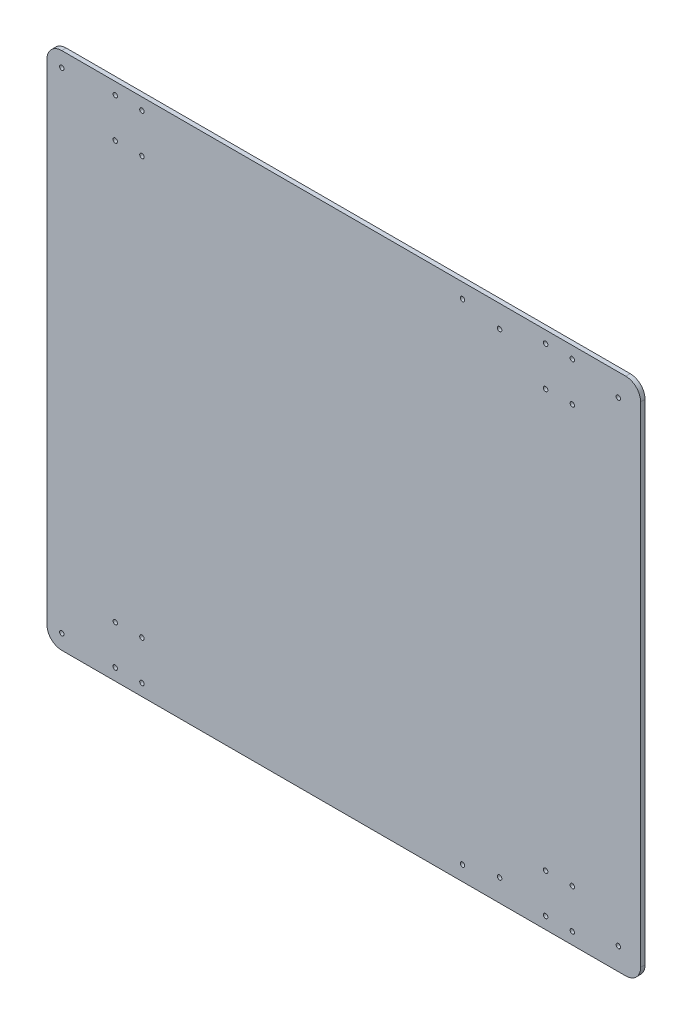
ISO-10303-21;
HEADER;
FILE_DESCRIPTION(('STEP AP214'),'2;1');
FILE_NAME('part.step','',(''),(''),'','','');
FILE_SCHEMA(('AUTOMOTIVE_DESIGN { 1 0 10303 214 1 1 1 1 }'));
ENDSEC;
DATA;
#1=APPLICATION_CONTEXT('core data for automotive mechanical design processes');
#2=APPLICATION_PROTOCOL_DEFINITION('international standard','automotive_design',2000,#1);
#3=PRODUCT_CONTEXT('',#1,'mechanical');
#4=PRODUCT('Part','Part','',(#3));
#5=PRODUCT_RELATED_PRODUCT_CATEGORY('part','',(#4));
#6=PRODUCT_DEFINITION_FORMATION('','',#4);
#7=PRODUCT_DEFINITION_CONTEXT('part definition',#1,'design');
#8=PRODUCT_DEFINITION('design','',#6,#7);
#9=PRODUCT_DEFINITION_SHAPE('','',#8);
#10=(LENGTH_UNIT() NAMED_UNIT(*) SI_UNIT(.MILLI.,.METRE.));
#11=(NAMED_UNIT(*) PLANE_ANGLE_UNIT() SI_UNIT($,.RADIAN.));
#12=(NAMED_UNIT(*) SI_UNIT($,.STERADIAN.) SOLID_ANGLE_UNIT());
#13=UNCERTAINTY_MEASURE_WITH_UNIT(LENGTH_MEASURE(1.E-05),#10,'distance_accuracy_value','');
#14=(GEOMETRIC_REPRESENTATION_CONTEXT(3) GLOBAL_UNCERTAINTY_ASSIGNED_CONTEXT((#13)) GLOBAL_UNIT_ASSIGNED_CONTEXT((#10,
#11,#12)) REPRESENTATION_CONTEXT('',''));
#15=CARTESIAN_POINT('',(0.,0.,0.));
#16=DIRECTION('',(0.,0.,1.));
#17=DIRECTION('',(1.,0.,0.));
#18=AXIS2_PLACEMENT_3D('',#15,#16,#17);
#19=CARTESIAN_POINT('',(390.,340.,3.));
#20=DIRECTION('',(0.,0.,-1.));
#21=DIRECTION('',(-1.,0.,0.));
#22=AXIS2_PLACEMENT_3D('',#19,#20,#21);
#23=CYLINDRICAL_SURFACE('',#22,10.);
#24=CARTESIAN_POINT('',(390.,340.,0.));
#25=DIRECTION('',(0.,0.,1.));
#26=DIRECTION('',(1.,0.,0.));
#27=AXIS2_PLACEMENT_3D('',#24,#25,#26);
#28=CIRCLE('',#27,10.);
#29=CARTESIAN_POINT('',(390.,350.,0.));
#30=VERTEX_POINT('',#29);
#31=CARTESIAN_POINT('',(400.,340.,0.));
#32=VERTEX_POINT('',#31);
#33=EDGE_CURVE('E157',#30,#32,#28,.F.);
#34=ORIENTED_EDGE('',*,*,#33,.F.);
#35=DIRECTION('',(0.,0.,-1.));
#36=VECTOR('',#35,1.);
#37=CARTESIAN_POINT('',(390.,350.,3.));
#38=LINE('',#37,#36);
#39=CARTESIAN_POINT('',(390.,350.,3.));
#40=VERTEX_POINT('',#39);
#41=EDGE_CURVE('E11',#40,#30,#38,.T.);
#42=ORIENTED_EDGE('',*,*,#41,.F.);
#43=CARTESIAN_POINT('',(390.,340.,3.));
#44=DIRECTION('',(0.,0.,1.));
#45=DIRECTION('',(1.,0.,0.));
#46=AXIS2_PLACEMENT_3D('',#43,#44,#45);
#47=CIRCLE('',#46,10.);
#48=CARTESIAN_POINT('',(400.,340.,3.));
#49=VERTEX_POINT('',#48);
#50=EDGE_CURVE('E638',#40,#49,#47,.F.);
#51=ORIENTED_EDGE('',*,*,#50,.T.);
#52=DIRECTION('',(0.,0.,-1.));
#53=VECTOR('',#52,1.);
#54=CARTESIAN_POINT('',(400.,340.,3.));
#55=LINE('',#54,#53);
#56=EDGE_CURVE('E91',#49,#32,#55,.T.);
#57=ORIENTED_EDGE('',*,*,#56,.T.);
#58=EDGE_LOOP('',(#34,#42,#51,#57));
#59=FACE_BOUND('',#58,.T.);
#60=ADVANCED_FACE('F40',(#59),#23,.T.);
#61=CARTESIAN_POINT('',(0.,350.,3.));
#62=DIRECTION('',(0.,1.,0.));
#63=DIRECTION('',(0.,0.,1.));
#64=AXIS2_PLACEMENT_3D('',#61,#62,#63);
#65=PLANE('',#64);
#66=DIRECTION('',(1.,0.,0.));
#67=VECTOR('',#66,1.);
#68=CARTESIAN_POINT('',(0.,350.,0.));
#69=LINE('',#68,#67);
#70=CARTESIAN_POINT('',(10.0000000000001,350.,0.));
#71=VERTEX_POINT('',#70);
#72=EDGE_CURVE('E155',#71,#30,#69,.T.);
#73=ORIENTED_EDGE('',*,*,#72,.F.);
#74=DIRECTION('',(0.,0.,-1.));
#75=VECTOR('',#74,1.);
#76=CARTESIAN_POINT('',(10.0000000000001,350.,3.));
#77=LINE('',#76,#75);
#78=CARTESIAN_POINT('',(10.0000000000001,350.,3.));
#79=VERTEX_POINT('',#78);
#80=EDGE_CURVE('E49',#79,#71,#77,.T.);
#81=ORIENTED_EDGE('',*,*,#80,.F.);
#82=DIRECTION('',(1.,0.,0.));
#83=VECTOR('',#82,1.);
#84=CARTESIAN_POINT('',(0.,350.,3.));
#85=LINE('',#84,#83);
#86=EDGE_CURVE('E640',#79,#40,#85,.T.);
#87=ORIENTED_EDGE('',*,*,#86,.T.);
#88=ORIENTED_EDGE('',*,*,#41,.T.);
#89=EDGE_LOOP('',(#73,#81,#87,#88));
#90=FACE_BOUND('',#89,.T.);
#91=ADVANCED_FACE('F156',(#90),#65,.T.);
#92=CARTESIAN_POINT('',(10.,340.,3.));
#93=DIRECTION('',(0.,0.,-1.));
#94=DIRECTION('',(-1.,0.,0.));
#95=AXIS2_PLACEMENT_3D('',#92,#93,#94);
#96=CYLINDRICAL_SURFACE('',#95,10.);
#97=CARTESIAN_POINT('',(10.,340.,0.));
#98=DIRECTION('',(0.,0.,1.));
#99=DIRECTION('',(1.,0.,0.));
#100=AXIS2_PLACEMENT_3D('',#97,#98,#99);
#101=CIRCLE('',#100,10.);
#102=CARTESIAN_POINT('',(0.,340.,0.));
#103=VERTEX_POINT('',#102);
#104=EDGE_CURVE('E147',#103,#71,#101,.F.);
#105=ORIENTED_EDGE('',*,*,#104,.F.);
#106=DIRECTION('',(0.,0.,-1.));
#107=VECTOR('',#106,1.);
#108=CARTESIAN_POINT('',(0.,340.,3.));
#109=LINE('',#108,#107);
#110=CARTESIAN_POINT('',(0.,340.,3.));
#111=VERTEX_POINT('',#110);
#112=EDGE_CURVE('E140',#111,#103,#109,.T.);
#113=ORIENTED_EDGE('',*,*,#112,.F.);
#114=CARTESIAN_POINT('',(10.,340.,3.));
#115=DIRECTION('',(0.,0.,1.));
#116=DIRECTION('',(1.,0.,0.));
#117=AXIS2_PLACEMENT_3D('',#114,#115,#116);
#118=CIRCLE('',#117,10.);
#119=EDGE_CURVE('E150',#111,#79,#118,.F.);
#120=ORIENTED_EDGE('',*,*,#119,.T.);
#121=ORIENTED_EDGE('',*,*,#80,.T.);
#122=EDGE_LOOP('',(#105,#113,#120,#121));
#123=FACE_BOUND('',#122,.T.);
#124=ADVANCED_FACE('F145',(#123),#96,.T.);
#125=CARTESIAN_POINT('',(0.,0.,3.));
#126=DIRECTION('',(-1.,0.,0.));
#127=DIRECTION('',(0.,0.,1.));
#128=AXIS2_PLACEMENT_3D('',#125,#126,#127);
#129=PLANE('',#128);
#130=DIRECTION('',(0.,1.,0.));
#131=VECTOR('',#130,1.);
#132=CARTESIAN_POINT('',(0.,0.,0.));
#133=LINE('',#132,#131);
#134=CARTESIAN_POINT('',(0.,10.0000000000001,0.));
#135=VERTEX_POINT('',#134);
#136=EDGE_CURVE('E163',#135,#103,#133,.T.);
#137=ORIENTED_EDGE('',*,*,#136,.F.);
#138=DIRECTION('',(0.,0.,-1.));
#139=VECTOR('',#138,1.);
#140=CARTESIAN_POINT('',(0.,10.0000000000001,3.));
#141=LINE('',#140,#139);
#142=CARTESIAN_POINT('',(0.,10.0000000000001,3.));
#143=VERTEX_POINT('',#142);
#144=EDGE_CURVE('E134',#143,#135,#141,.T.);
#145=ORIENTED_EDGE('',*,*,#144,.F.);
#146=DIRECTION('',(0.,1.,0.));
#147=VECTOR('',#146,1.);
#148=CARTESIAN_POINT('',(0.,0.,3.));
#149=LINE('',#148,#147);
#150=EDGE_CURVE('E643',#143,#111,#149,.T.);
#151=ORIENTED_EDGE('',*,*,#150,.T.);
#152=ORIENTED_EDGE('',*,*,#112,.T.);
#153=EDGE_LOOP('',(#137,#145,#151,#152));
#154=FACE_BOUND('',#153,.T.);
#155=ADVANCED_FACE('F406',(#154),#129,.T.);
#156=CARTESIAN_POINT('',(10.,10.,3.));
#157=DIRECTION('',(0.,0.,-1.));
#158=DIRECTION('',(-1.,0.,0.));
#159=AXIS2_PLACEMENT_3D('',#156,#157,#158);
#160=CYLINDRICAL_SURFACE('',#159,10.);
#161=CARTESIAN_POINT('',(10.,10.,0.));
#162=DIRECTION('',(0.,0.,1.));
#163=DIRECTION('',(1.,0.,0.));
#164=AXIS2_PLACEMENT_3D('',#161,#162,#163);
#165=CIRCLE('',#164,10.);
#166=CARTESIAN_POINT('',(10.0000000000001,0.,0.));
#167=VERTEX_POINT('',#166);
#168=EDGE_CURVE('E165',#167,#135,#165,.F.);
#169=ORIENTED_EDGE('',*,*,#168,.F.);
#170=DIRECTION('',(0.,0.,-1.));
#171=VECTOR('',#170,1.);
#172=CARTESIAN_POINT('',(10.0000000000001,0.,3.));
#173=LINE('',#172,#171);
#174=CARTESIAN_POINT('',(10.0000000000001,0.,3.));
#175=VERTEX_POINT('',#174);
#176=EDGE_CURVE('E132',#175,#167,#173,.T.);
#177=ORIENTED_EDGE('',*,*,#176,.F.);
#178=CARTESIAN_POINT('',(10.,10.,3.));
#179=DIRECTION('',(0.,0.,1.));
#180=DIRECTION('',(1.,0.,0.));
#181=AXIS2_PLACEMENT_3D('',#178,#179,#180);
#182=CIRCLE('',#181,10.);
#183=EDGE_CURVE('E126',#175,#143,#182,.F.);
#184=ORIENTED_EDGE('',*,*,#183,.T.);
#185=ORIENTED_EDGE('',*,*,#144,.T.);
#186=EDGE_LOOP('',(#169,#177,#184,#185));
#187=FACE_BOUND('',#186,.T.);
#188=ADVANCED_FACE('F403',(#187),#160,.T.);
#189=CARTESIAN_POINT('',(0.,0.,3.));
#190=DIRECTION('',(0.,1.,0.));
#191=DIRECTION('',(0.,0.,1.));
#192=AXIS2_PLACEMENT_3D('',#189,#190,#191);
#193=PLANE('',#192);
#194=DIRECTION('',(1.,0.,0.));
#195=VECTOR('',#194,1.);
#196=CARTESIAN_POINT('',(0.,0.,0.));
#197=LINE('',#196,#195);
#198=CARTESIAN_POINT('',(390.,0.,0.));
#199=VERTEX_POINT('',#198);
#200=EDGE_CURVE('E131',#167,#199,#197,.T.);
#201=ORIENTED_EDGE('',*,*,#200,.T.);
#202=DIRECTION('',(0.,0.,-1.));
#203=VECTOR('',#202,1.);
#204=CARTESIAN_POINT('',(390.,0.,3.));
#205=LINE('',#204,#203);
#206=CARTESIAN_POINT('',(390.,0.,3.));
#207=VERTEX_POINT('',#206);
#208=EDGE_CURVE('E115',#207,#199,#205,.T.);
#209=ORIENTED_EDGE('',*,*,#208,.F.);
#210=DIRECTION('',(1.,0.,0.));
#211=VECTOR('',#210,1.);
#212=CARTESIAN_POINT('',(0.,0.,3.));
#213=LINE('',#212,#211);
#214=EDGE_CURVE('E118',#175,#207,#213,.T.);
#215=ORIENTED_EDGE('',*,*,#214,.F.);
#216=ORIENTED_EDGE('',*,*,#176,.T.);
#217=EDGE_LOOP('',(#201,#209,#215,#216));
#218=FACE_BOUND('',#217,.T.);
#219=ADVANCED_FACE('F129',(#218),#193,.F.);
#220=CARTESIAN_POINT('',(390.,10.,3.));
#221=DIRECTION('',(0.,0.,-1.));
#222=DIRECTION('',(-1.,0.,0.));
#223=AXIS2_PLACEMENT_3D('',#220,#221,#222);
#224=CYLINDRICAL_SURFACE('',#223,10.);
#225=CARTESIAN_POINT('',(390.,10.,0.));
#226=DIRECTION('',(0.,0.,1.));
#227=DIRECTION('',(1.,0.,0.));
#228=AXIS2_PLACEMENT_3D('',#225,#226,#227);
#229=CIRCLE('',#228,10.);
#230=CARTESIAN_POINT('',(400.,10.0000000000001,0.));
#231=VERTEX_POINT('',#230);
#232=EDGE_CURVE('E171',#199,#231,#229,.T.);
#233=ORIENTED_EDGE('',*,*,#232,.T.);
#234=DIRECTION('',(0.,0.,-1.));
#235=VECTOR('',#234,1.);
#236=CARTESIAN_POINT('',(400.,10.0000000000001,3.));
#237=LINE('',#236,#235);
#238=CARTESIAN_POINT('',(400.,10.0000000000001,3.));
#239=VERTEX_POINT('',#238);
#240=EDGE_CURVE('E117',#239,#231,#237,.T.);
#241=ORIENTED_EDGE('',*,*,#240,.F.);
#242=CARTESIAN_POINT('',(390.,10.,3.));
#243=DIRECTION('',(0.,0.,1.));
#244=DIRECTION('',(1.,0.,0.));
#245=AXIS2_PLACEMENT_3D('',#242,#243,#244);
#246=CIRCLE('',#245,10.);
#247=EDGE_CURVE('E110',#207,#239,#246,.T.);
#248=ORIENTED_EDGE('',*,*,#247,.F.);
#249=ORIENTED_EDGE('',*,*,#208,.T.);
#250=EDGE_LOOP('',(#233,#241,#248,#249));
#251=FACE_BOUND('',#250,.T.);
#252=ADVANCED_FACE('F113',(#251),#224,.T.);
#253=CARTESIAN_POINT('',(45.9999999999999,34.48,3.));
#254=DIRECTION('',(0.,0.,-1.));
#255=DIRECTION('',(-1.,0.,0.));
#256=AXIS2_PLACEMENT_3D('',#253,#254,#255);
#257=CYLINDRICAL_SURFACE('',#256,1.50000000000003);
#258=CARTESIAN_POINT('',(45.9999999999999,34.48,3.));
#259=DIRECTION('',(0.,0.,1.));
#260=DIRECTION('',(1.,0.,0.));
#261=AXIS2_PLACEMENT_3D('',#258,#259,#260);
#262=CIRCLE('',#261,1.50000000000003);
#263=CARTESIAN_POINT('',(47.5,34.48,3.));
#264=VERTEX_POINT('',#263);
#265=EDGE_CURVE('E188',#264,#264,#262,.F.);
#266=ORIENTED_EDGE('',*,*,#265,.F.);
#267=EDGE_LOOP('',(#266));
#268=FACE_BOUND('',#267,.T.);
#269=CARTESIAN_POINT('',(45.9999999999999,34.48,0.));
#270=DIRECTION('',(0.,0.,1.));
#271=DIRECTION('',(1.,0.,0.));
#272=AXIS2_PLACEMENT_3D('',#269,#270,#271);
#273=CIRCLE('',#272,1.50000000000003);
#274=CARTESIAN_POINT('',(47.5,34.48,0.));
#275=VERTEX_POINT('',#274);
#276=EDGE_CURVE('E180',#275,#275,#273,.F.);
#277=ORIENTED_EDGE('',*,*,#276,.T.);
#278=EDGE_LOOP('',(#277));
#279=FACE_BOUND('',#278,.T.);
#280=ADVANCED_FACE('F384',(#268,#279),#257,.F.);
#281=CARTESIAN_POINT('',(354.,342.,3.));
#282=DIRECTION('',(0.,0.,-1.));
#283=DIRECTION('',(-1.,0.,0.));
#284=AXIS2_PLACEMENT_3D('',#281,#282,#283);
#285=CYLINDRICAL_SURFACE('',#284,1.50000000000002);
#286=CARTESIAN_POINT('',(354.,342.,3.));
#287=DIRECTION('',(0.,0.,1.));
#288=DIRECTION('',(1.,0.,0.));
#289=AXIS2_PLACEMENT_3D('',#286,#287,#288);
#290=CIRCLE('',#289,1.50000000000002);
#291=CARTESIAN_POINT('',(355.5,342.,3.));
#292=VERTEX_POINT('',#291);
#293=EDGE_CURVE('E193',#292,#292,#290,.F.);
#294=ORIENTED_EDGE('',*,*,#293,.F.);
#295=EDGE_LOOP('',(#294));
#296=FACE_BOUND('',#295,.T.);
#297=CARTESIAN_POINT('',(354.,342.,0.));
#298=DIRECTION('',(0.,0.,1.));
#299=DIRECTION('',(1.,0.,0.));
#300=AXIS2_PLACEMENT_3D('',#297,#298,#299);
#301=CIRCLE('',#300,1.50000000000002);
#302=CARTESIAN_POINT('',(355.5,342.,0.));
#303=VERTEX_POINT('',#302);
#304=EDGE_CURVE('E177',#303,#303,#301,.F.);
#305=ORIENTED_EDGE('',*,*,#304,.T.);
#306=EDGE_LOOP('',(#305));
#307=FACE_BOUND('',#306,.T.);
#308=ADVANCED_FACE('F387',(#296,#307),#285,.F.);
#309=CARTESIAN_POINT('',(336.,315.52,3.));
#310=DIRECTION('',(0.,0.,-1.));
#311=DIRECTION('',(-1.,0.,0.));
#312=AXIS2_PLACEMENT_3D('',#309,#310,#311);
#313=CYLINDRICAL_SURFACE('',#312,1.50000000000002);
#314=CARTESIAN_POINT('',(336.,315.52,3.));
#315=DIRECTION('',(0.,0.,1.));
#316=DIRECTION('',(1.,0.,0.));
#317=AXIS2_PLACEMENT_3D('',#314,#315,#316);
#318=CIRCLE('',#317,1.50000000000002);
#319=CARTESIAN_POINT('',(337.5,315.52,3.));
#320=VERTEX_POINT('',#319);
#321=EDGE_CURVE('E648',#320,#320,#318,.F.);
#322=ORIENTED_EDGE('',*,*,#321,.F.);
#323=EDGE_LOOP('',(#322));
#324=FACE_BOUND('',#323,.T.);
#325=CARTESIAN_POINT('',(336.,315.52,0.));
#326=DIRECTION('',(0.,0.,1.));
#327=DIRECTION('',(1.,0.,0.));
#328=AXIS2_PLACEMENT_3D('',#325,#326,#327);
#329=CIRCLE('',#328,1.50000000000002);
#330=CARTESIAN_POINT('',(337.5,315.52,0.));
#331=VERTEX_POINT('',#330);
#332=EDGE_CURVE('E174',#331,#331,#329,.F.);
#333=ORIENTED_EDGE('',*,*,#332,.T.);
#334=EDGE_LOOP('',(#333));
#335=FACE_BOUND('',#334,.T.);
#336=ADVANCED_FACE('F391',(#324,#335),#313,.F.);
#337=CARTESIAN_POINT('',(400.,0.,3.));
#338=DIRECTION('',(-1.,0.,0.));
#339=DIRECTION('',(0.,0.,1.));
#340=AXIS2_PLACEMENT_3D('',#337,#338,#339);
#341=PLANE('',#340);
#342=DIRECTION('',(0.,1.,0.));
#343=VECTOR('',#342,1.);
#344=CARTESIAN_POINT('',(400.,0.,0.));
#345=LINE('',#344,#343);
#346=EDGE_CURVE('E84',#231,#32,#345,.T.);
#347=ORIENTED_EDGE('',*,*,#346,.T.);
#348=ORIENTED_EDGE('',*,*,#56,.F.);
#349=DIRECTION('',(0.,1.,0.));
#350=VECTOR('',#349,1.);
#351=CARTESIAN_POINT('',(400.,0.,3.));
#352=LINE('',#351,#350);
#353=EDGE_CURVE('E57',#239,#49,#352,.T.);
#354=ORIENTED_EDGE('',*,*,#353,.F.);
#355=ORIENTED_EDGE('',*,*,#240,.T.);
#356=EDGE_LOOP('',(#347,#348,#354,#355));
#357=FACE_BOUND('',#356,.T.);
#358=ADVANCED_FACE('F257',(#357),#341,.F.);
#359=CARTESIAN_POINT('',(385.,15.,3.));
#360=DIRECTION('',(0.,0.,-1.));
#361=DIRECTION('',(-1.,0.,0.));
#362=AXIS2_PLACEMENT_3D('',#359,#360,#361);
#363=CYLINDRICAL_SURFACE('',#362,1.50000000000002);
#364=CARTESIAN_POINT('',(385.,15.,3.));
#365=DIRECTION('',(0.,0.,1.));
#366=DIRECTION('',(1.,0.,0.));
#367=AXIS2_PLACEMENT_3D('',#364,#365,#366);
#368=CIRCLE('',#367,1.50000000000002);
#369=CARTESIAN_POINT('',(386.5,15.,3.));
#370=VERTEX_POINT('',#369);
#371=EDGE_CURVE('E635',#370,#370,#368,.T.);
#372=ORIENTED_EDGE('',*,*,#371,.T.);
#373=EDGE_LOOP('',(#372));
#374=FACE_BOUND('',#373,.T.);
#375=CARTESIAN_POINT('',(385.,15.,0.));
#376=DIRECTION('',(0.,0.,1.));
#377=DIRECTION('',(1.,0.,0.));
#378=AXIS2_PLACEMENT_3D('',#375,#376,#377);
#379=CIRCLE('',#378,1.50000000000002);
#380=CARTESIAN_POINT('',(386.5,15.,0.));
#381=VERTEX_POINT('',#380);
#382=EDGE_CURVE('E243',#381,#381,#379,.T.);
#383=ORIENTED_EDGE('',*,*,#382,.F.);
#384=EDGE_LOOP('',(#383));
#385=FACE_BOUND('',#384,.T.);
#386=ADVANCED_FACE('F253',(#374,#385),#363,.F.);
#387=CARTESIAN_POINT('',(305.,15.,3.));
#388=DIRECTION('',(0.,0.,-1.));
#389=DIRECTION('',(-1.,0.,0.));
#390=AXIS2_PLACEMENT_3D('',#387,#388,#389);
#391=CYLINDRICAL_SURFACE('',#390,1.50000000000002);
#392=CARTESIAN_POINT('',(305.,15.,3.));
#393=DIRECTION('',(0.,0.,1.));
#394=DIRECTION('',(1.,0.,0.));
#395=AXIS2_PLACEMENT_3D('',#392,#393,#394);
#396=CIRCLE('',#395,1.50000000000002);
#397=CARTESIAN_POINT('',(306.5,15.,3.));
#398=VERTEX_POINT('',#397);
#399=EDGE_CURVE('E632',#398,#398,#396,.T.);
#400=ORIENTED_EDGE('',*,*,#399,.T.);
#401=EDGE_LOOP('',(#400));
#402=FACE_BOUND('',#401,.T.);
#403=CARTESIAN_POINT('',(305.,15.,0.));
#404=DIRECTION('',(0.,0.,1.));
#405=DIRECTION('',(1.,0.,0.));
#406=AXIS2_PLACEMENT_3D('',#403,#404,#405);
#407=CIRCLE('',#406,1.50000000000002);
#408=CARTESIAN_POINT('',(306.5,15.,0.));
#409=VERTEX_POINT('',#408);
#410=EDGE_CURVE('E240',#409,#409,#407,.T.);
#411=ORIENTED_EDGE('',*,*,#410,.F.);
#412=EDGE_LOOP('',(#411));
#413=FACE_BOUND('',#412,.T.);
#414=ADVANCED_FACE('F256',(#402,#413),#391,.F.);
#415=CARTESIAN_POINT('',(305.,335.,3.));
#416=DIRECTION('',(0.,0.,-1.));
#417=DIRECTION('',(-1.,0.,0.));
#418=AXIS2_PLACEMENT_3D('',#415,#416,#417);
#419=CYLINDRICAL_SURFACE('',#418,1.50000000000002);
#420=CARTESIAN_POINT('',(305.,335.,3.));
#421=DIRECTION('',(0.,0.,1.));
#422=DIRECTION('',(1.,0.,0.));
#423=AXIS2_PLACEMENT_3D('',#420,#421,#422);
#424=CIRCLE('',#423,1.50000000000002);
#425=CARTESIAN_POINT('',(306.5,335.,3.));
#426=VERTEX_POINT('',#425);
#427=EDGE_CURVE('E629',#426,#426,#424,.T.);
#428=ORIENTED_EDGE('',*,*,#427,.T.);
#429=EDGE_LOOP('',(#428));
#430=FACE_BOUND('',#429,.T.);
#431=CARTESIAN_POINT('',(305.,335.,0.));
#432=DIRECTION('',(0.,0.,1.));
#433=DIRECTION('',(1.,0.,0.));
#434=AXIS2_PLACEMENT_3D('',#431,#432,#433);
#435=CIRCLE('',#434,1.50000000000002);
#436=CARTESIAN_POINT('',(306.5,335.,0.));
#437=VERTEX_POINT('',#436);
#438=EDGE_CURVE('E237',#437,#437,#435,.T.);
#439=ORIENTED_EDGE('',*,*,#438,.F.);
#440=EDGE_LOOP('',(#439));
#441=FACE_BOUND('',#440,.T.);
#442=ADVANCED_FACE('F261',(#430,#441),#419,.F.);
#443=CARTESIAN_POINT('',(385.,335.,3.));
#444=DIRECTION('',(0.,0.,-1.));
#445=DIRECTION('',(-1.,0.,0.));
#446=AXIS2_PLACEMENT_3D('',#443,#444,#445);
#447=CYLINDRICAL_SURFACE('',#446,1.50000000000002);
#448=CARTESIAN_POINT('',(385.,335.,3.));
#449=DIRECTION('',(0.,0.,1.));
#450=DIRECTION('',(1.,0.,0.));
#451=AXIS2_PLACEMENT_3D('',#448,#449,#450);
#452=CIRCLE('',#451,1.50000000000002);
#453=CARTESIAN_POINT('',(386.5,335.,3.));
#454=VERTEX_POINT('',#453);
#455=EDGE_CURVE('E626',#454,#454,#452,.T.);
#456=ORIENTED_EDGE('',*,*,#455,.T.);
#457=EDGE_LOOP('',(#456));
#458=FACE_BOUND('',#457,.T.);
#459=CARTESIAN_POINT('',(385.,335.,0.));
#460=DIRECTION('',(0.,0.,1.));
#461=DIRECTION('',(1.,0.,0.));
#462=AXIS2_PLACEMENT_3D('',#459,#460,#461);
#463=CIRCLE('',#462,1.50000000000002);
#464=CARTESIAN_POINT('',(386.5,335.,0.));
#465=VERTEX_POINT('',#464);
#466=EDGE_CURVE('E234',#465,#465,#463,.T.);
#467=ORIENTED_EDGE('',*,*,#466,.F.);
#468=EDGE_LOOP('',(#467));
#469=FACE_BOUND('',#468,.T.);
#470=ADVANCED_FACE('F265',(#458,#469),#447,.F.);
#471=CARTESIAN_POINT('',(354.,8.,3.));
#472=DIRECTION('',(0.,0.,-1.));
#473=DIRECTION('',(-1.,0.,0.));
#474=AXIS2_PLACEMENT_3D('',#471,#472,#473);
#475=CYLINDRICAL_SURFACE('',#474,1.50000000000002);
#476=CARTESIAN_POINT('',(354.,8.,3.));
#477=DIRECTION('',(0.,0.,1.));
#478=DIRECTION('',(1.,0.,0.));
#479=AXIS2_PLACEMENT_3D('',#476,#477,#478);
#480=CIRCLE('',#479,1.50000000000002);
#481=CARTESIAN_POINT('',(355.5,8.,3.));
#482=VERTEX_POINT('',#481);
#483=EDGE_CURVE('E623',#482,#482,#480,.T.);
#484=ORIENTED_EDGE('',*,*,#483,.T.);
#485=EDGE_LOOP('',(#484));
#486=FACE_BOUND('',#485,.T.);
#487=CARTESIAN_POINT('',(354.,8.,0.));
#488=DIRECTION('',(0.,0.,1.));
#489=DIRECTION('',(1.,0.,0.));
#490=AXIS2_PLACEMENT_3D('',#487,#488,#489);
#491=CIRCLE('',#490,1.50000000000002);
#492=CARTESIAN_POINT('',(355.5,8.,0.));
#493=VERTEX_POINT('',#492);
#494=EDGE_CURVE('E231',#493,#493,#491,.T.);
#495=ORIENTED_EDGE('',*,*,#494,.F.);
#496=EDGE_LOOP('',(#495));
#497=FACE_BOUND('',#496,.T.);
#498=ADVANCED_FACE('F269',(#486,#497),#475,.F.);
#499=CARTESIAN_POINT('',(336.,8.,3.));
#500=DIRECTION('',(0.,0.,-1.));
#501=DIRECTION('',(-1.,0.,0.));
#502=AXIS2_PLACEMENT_3D('',#499,#500,#501);
#503=CYLINDRICAL_SURFACE('',#502,1.50000000000002);
#504=CARTESIAN_POINT('',(336.,8.,3.));
#505=DIRECTION('',(0.,0.,1.));
#506=DIRECTION('',(1.,0.,0.));
#507=AXIS2_PLACEMENT_3D('',#504,#505,#506);
#508=CIRCLE('',#507,1.50000000000002);
#509=CARTESIAN_POINT('',(337.5,8.,3.));
#510=VERTEX_POINT('',#509);
#511=EDGE_CURVE('E620',#510,#510,#508,.T.);
#512=ORIENTED_EDGE('',*,*,#511,.T.);
#513=EDGE_LOOP('',(#512));
#514=FACE_BOUND('',#513,.T.);
#515=CARTESIAN_POINT('',(336.,8.,0.));
#516=DIRECTION('',(0.,0.,1.));
#517=DIRECTION('',(1.,0.,0.));
#518=AXIS2_PLACEMENT_3D('',#515,#516,#517);
#519=CIRCLE('',#518,1.50000000000002);
#520=CARTESIAN_POINT('',(337.5,8.,0.));
#521=VERTEX_POINT('',#520);
#522=EDGE_CURVE('E228',#521,#521,#519,.T.);
#523=ORIENTED_EDGE('',*,*,#522,.F.);
#524=EDGE_LOOP('',(#523));
#525=FACE_BOUND('',#524,.T.);
#526=ADVANCED_FACE('F273',(#514,#525),#503,.F.);
#527=CARTESIAN_POINT('',(336.,34.48,3.));
#528=DIRECTION('',(0.,0.,-1.));
#529=DIRECTION('',(-1.,0.,0.));
#530=AXIS2_PLACEMENT_3D('',#527,#528,#529);
#531=CYLINDRICAL_SURFACE('',#530,1.50000000000002);
#532=CARTESIAN_POINT('',(336.,34.48,3.));
#533=DIRECTION('',(0.,0.,1.));
#534=DIRECTION('',(1.,0.,0.));
#535=AXIS2_PLACEMENT_3D('',#532,#533,#534);
#536=CIRCLE('',#535,1.50000000000002);
#537=CARTESIAN_POINT('',(337.5,34.48,3.));
#538=VERTEX_POINT('',#537);
#539=EDGE_CURVE('E617',#538,#538,#536,.T.);
#540=ORIENTED_EDGE('',*,*,#539,.T.);
#541=EDGE_LOOP('',(#540));
#542=FACE_BOUND('',#541,.T.);
#543=CARTESIAN_POINT('',(336.,34.48,0.));
#544=DIRECTION('',(0.,0.,1.));
#545=DIRECTION('',(1.,0.,0.));
#546=AXIS2_PLACEMENT_3D('',#543,#544,#545);
#547=CIRCLE('',#546,1.50000000000002);
#548=CARTESIAN_POINT('',(337.5,34.48,0.));
#549=VERTEX_POINT('',#548);
#550=EDGE_CURVE('E225',#549,#549,#547,.T.);
#551=ORIENTED_EDGE('',*,*,#550,.F.);
#552=EDGE_LOOP('',(#551));
#553=FACE_BOUND('',#552,.T.);
#554=ADVANCED_FACE('F277',(#542,#553),#531,.F.);
#555=CARTESIAN_POINT('',(354.,34.48,3.));
#556=DIRECTION('',(0.,0.,-1.));
#557=DIRECTION('',(-1.,0.,0.));
#558=AXIS2_PLACEMENT_3D('',#555,#556,#557);
#559=CYLINDRICAL_SURFACE('',#558,1.50000000000002);
#560=CARTESIAN_POINT('',(354.,34.48,3.));
#561=DIRECTION('',(0.,0.,1.));
#562=DIRECTION('',(1.,0.,0.));
#563=AXIS2_PLACEMENT_3D('',#560,#561,#562);
#564=CIRCLE('',#563,1.50000000000002);
#565=CARTESIAN_POINT('',(355.5,34.48,3.));
#566=VERTEX_POINT('',#565);
#567=EDGE_CURVE('E614',#566,#566,#564,.T.);
#568=ORIENTED_EDGE('',*,*,#567,.T.);
#569=EDGE_LOOP('',(#568));
#570=FACE_BOUND('',#569,.T.);
#571=CARTESIAN_POINT('',(354.,34.48,0.));
#572=DIRECTION('',(0.,0.,1.));
#573=DIRECTION('',(1.,0.,0.));
#574=AXIS2_PLACEMENT_3D('',#571,#572,#573);
#575=CIRCLE('',#574,1.50000000000002);
#576=CARTESIAN_POINT('',(355.5,34.48,0.));
#577=VERTEX_POINT('',#576);
#578=EDGE_CURVE('E222',#577,#577,#575,.T.);
#579=ORIENTED_EDGE('',*,*,#578,.F.);
#580=EDGE_LOOP('',(#579));
#581=FACE_BOUND('',#580,.T.);
#582=ADVANCED_FACE('F281',(#570,#581),#559,.F.);
#583=CARTESIAN_POINT('',(336.,342.,3.));
#584=DIRECTION('',(0.,0.,-1.));
#585=DIRECTION('',(-1.,0.,0.));
#586=AXIS2_PLACEMENT_3D('',#583,#584,#585);
#587=CYLINDRICAL_SURFACE('',#586,1.50000000000002);
#588=CARTESIAN_POINT('',(336.,342.,3.));
#589=DIRECTION('',(0.,0.,1.));
#590=DIRECTION('',(1.,0.,0.));
#591=AXIS2_PLACEMENT_3D('',#588,#589,#590);
#592=CIRCLE('',#591,1.50000000000002);
#593=CARTESIAN_POINT('',(337.5,342.,3.));
#594=VERTEX_POINT('',#593);
#595=EDGE_CURVE('E611',#594,#594,#592,.F.);
#596=ORIENTED_EDGE('',*,*,#595,.F.);
#597=EDGE_LOOP('',(#596));
#598=FACE_BOUND('',#597,.T.);
#599=CARTESIAN_POINT('',(336.,342.,0.));
#600=DIRECTION('',(0.,0.,1.));
#601=DIRECTION('',(1.,0.,0.));
#602=AXIS2_PLACEMENT_3D('',#599,#600,#601);
#603=CIRCLE('',#602,1.50000000000002);
#604=CARTESIAN_POINT('',(337.5,342.,0.));
#605=VERTEX_POINT('',#604);
#606=EDGE_CURVE('E219',#605,#605,#603,.F.);
#607=ORIENTED_EDGE('',*,*,#606,.T.);
#608=EDGE_LOOP('',(#607));
#609=FACE_BOUND('',#608,.T.);
#610=ADVANCED_FACE('F285',(#598,#609),#587,.F.);
#611=CARTESIAN_POINT('',(354.,315.52,3.));
#612=DIRECTION('',(0.,0.,-1.));
#613=DIRECTION('',(-1.,0.,0.));
#614=AXIS2_PLACEMENT_3D('',#611,#612,#613);
#615=CYLINDRICAL_SURFACE('',#614,1.50000000000002);
#616=CARTESIAN_POINT('',(354.,315.52,3.));
#617=DIRECTION('',(0.,0.,1.));
#618=DIRECTION('',(1.,0.,0.));
#619=AXIS2_PLACEMENT_3D('',#616,#617,#618);
#620=CIRCLE('',#619,1.50000000000002);
#621=CARTESIAN_POINT('',(355.5,315.52,3.));
#622=VERTEX_POINT('',#621);
#623=EDGE_CURVE('E608',#622,#622,#620,.F.);
#624=ORIENTED_EDGE('',*,*,#623,.F.);
#625=EDGE_LOOP('',(#624));
#626=FACE_BOUND('',#625,.T.);
#627=CARTESIAN_POINT('',(354.,315.52,0.));
#628=DIRECTION('',(0.,0.,1.));
#629=DIRECTION('',(1.,0.,0.));
#630=AXIS2_PLACEMENT_3D('',#627,#628,#629);
#631=CIRCLE('',#630,1.50000000000002);
#632=CARTESIAN_POINT('',(355.5,315.52,0.));
#633=VERTEX_POINT('',#632);
#634=EDGE_CURVE('E216',#633,#633,#631,.F.);
#635=ORIENTED_EDGE('',*,*,#634,.T.);
#636=EDGE_LOOP('',(#635));
#637=FACE_BOUND('',#636,.T.);
#638=ADVANCED_FACE('F289',(#626,#637),#615,.F.);
#639=CARTESIAN_POINT('',(63.9999999999999,34.48,3.));
#640=DIRECTION('',(0.,0.,-1.));
#641=DIRECTION('',(-1.,0.,0.));
#642=AXIS2_PLACEMENT_3D('',#639,#640,#641);
#643=CYLINDRICAL_SURFACE('',#642,1.50000000000003);
#644=CARTESIAN_POINT('',(63.9999999999999,34.48,3.));
#645=DIRECTION('',(0.,0.,1.));
#646=DIRECTION('',(1.,0.,0.));
#647=AXIS2_PLACEMENT_3D('',#644,#645,#646);
#648=CIRCLE('',#647,1.50000000000003);
#649=CARTESIAN_POINT('',(65.5,34.48,3.));
#650=VERTEX_POINT('',#649);
#651=EDGE_CURVE('E605',#650,#650,#648,.F.);
#652=ORIENTED_EDGE('',*,*,#651,.F.);
#653=EDGE_LOOP('',(#652));
#654=FACE_BOUND('',#653,.T.);
#655=CARTESIAN_POINT('',(63.9999999999999,34.48,0.));
#656=DIRECTION('',(0.,0.,1.));
#657=DIRECTION('',(1.,0.,0.));
#658=AXIS2_PLACEMENT_3D('',#655,#656,#657);
#659=CIRCLE('',#658,1.50000000000003);
#660=CARTESIAN_POINT('',(65.5,34.48,0.));
#661=VERTEX_POINT('',#660);
#662=EDGE_CURVE('E213',#661,#661,#659,.F.);
#663=ORIENTED_EDGE('',*,*,#662,.T.);
#664=EDGE_LOOP('',(#663));
#665=FACE_BOUND('',#664,.T.);
#666=ADVANCED_FACE('F293',(#654,#665),#643,.F.);
#667=CARTESIAN_POINT('',(46.,7.99999999999996,3.));
#668=DIRECTION('',(0.,0.,-1.));
#669=DIRECTION('',(-1.,0.,0.));
#670=AXIS2_PLACEMENT_3D('',#667,#668,#669);
#671=CYLINDRICAL_SURFACE('',#670,1.50000000000003);
#672=CARTESIAN_POINT('',(46.,7.99999999999996,3.));
#673=DIRECTION('',(0.,0.,1.));
#674=DIRECTION('',(1.,0.,0.));
#675=AXIS2_PLACEMENT_3D('',#672,#673,#674);
#676=CIRCLE('',#675,1.50000000000003);
#677=CARTESIAN_POINT('',(47.5,7.99999999999996,3.));
#678=VERTEX_POINT('',#677);
#679=EDGE_CURVE('E602',#678,#678,#676,.F.);
#680=ORIENTED_EDGE('',*,*,#679,.F.);
#681=EDGE_LOOP('',(#680));
#682=FACE_BOUND('',#681,.T.);
#683=CARTESIAN_POINT('',(46.,7.99999999999996,0.));
#684=DIRECTION('',(0.,0.,1.));
#685=DIRECTION('',(1.,0.,0.));
#686=AXIS2_PLACEMENT_3D('',#683,#684,#685);
#687=CIRCLE('',#686,1.50000000000003);
#688=CARTESIAN_POINT('',(47.5,7.99999999999996,0.));
#689=VERTEX_POINT('',#688);
#690=EDGE_CURVE('E210',#689,#689,#687,.F.);
#691=ORIENTED_EDGE('',*,*,#690,.T.);
#692=EDGE_LOOP('',(#691));
#693=FACE_BOUND('',#692,.T.);
#694=ADVANCED_FACE('F297',(#682,#693),#671,.F.);
#695=CARTESIAN_POINT('',(45.9999999999999,315.52,3.));
#696=DIRECTION('',(0.,0.,-1.));
#697=DIRECTION('',(-1.,0.,0.));
#698=AXIS2_PLACEMENT_3D('',#695,#696,#697);
#699=CYLINDRICAL_SURFACE('',#698,1.50000000000002);
#700=CARTESIAN_POINT('',(45.9999999999999,315.52,3.));
#701=DIRECTION('',(0.,0.,1.));
#702=DIRECTION('',(1.,0.,0.));
#703=AXIS2_PLACEMENT_3D('',#700,#701,#702);
#704=CIRCLE('',#703,1.50000000000002);
#705=CARTESIAN_POINT('',(47.4999999999999,315.52,3.));
#706=VERTEX_POINT('',#705);
#707=EDGE_CURVE('E599',#706,#706,#704,.T.);
#708=ORIENTED_EDGE('',*,*,#707,.T.);
#709=EDGE_LOOP('',(#708));
#710=FACE_BOUND('',#709,.T.);
#711=CARTESIAN_POINT('',(45.9999999999999,315.52,0.));
#712=DIRECTION('',(0.,0.,1.));
#713=DIRECTION('',(1.,0.,0.));
#714=AXIS2_PLACEMENT_3D('',#711,#712,#713);
#715=CIRCLE('',#714,1.50000000000002);
#716=CARTESIAN_POINT('',(47.4999999999999,315.52,0.));
#717=VERTEX_POINT('',#716);
#718=EDGE_CURVE('E207',#717,#717,#715,.T.);
#719=ORIENTED_EDGE('',*,*,#718,.F.);
#720=EDGE_LOOP('',(#719));
#721=FACE_BOUND('',#720,.T.);
#722=ADVANCED_FACE('F301',(#710,#721),#699,.F.);
#723=CARTESIAN_POINT('',(45.9999999999999,342.,3.));
#724=DIRECTION('',(0.,0.,-1.));
#725=DIRECTION('',(-1.,0.,0.));
#726=AXIS2_PLACEMENT_3D('',#723,#724,#725);
#727=CYLINDRICAL_SURFACE('',#726,1.50000000000002);
#728=CARTESIAN_POINT('',(45.9999999999999,342.,3.));
#729=DIRECTION('',(0.,0.,1.));
#730=DIRECTION('',(1.,0.,0.));
#731=AXIS2_PLACEMENT_3D('',#728,#729,#730);
#732=CIRCLE('',#731,1.50000000000002);
#733=CARTESIAN_POINT('',(47.4999999999999,342.,3.));
#734=VERTEX_POINT('',#733);
#735=EDGE_CURVE('E596',#734,#734,#732,.T.);
#736=ORIENTED_EDGE('',*,*,#735,.T.);
#737=EDGE_LOOP('',(#736));
#738=FACE_BOUND('',#737,.T.);
#739=CARTESIAN_POINT('',(45.9999999999999,342.,0.));
#740=DIRECTION('',(0.,0.,1.));
#741=DIRECTION('',(1.,0.,0.));
#742=AXIS2_PLACEMENT_3D('',#739,#740,#741);
#743=CIRCLE('',#742,1.50000000000002);
#744=CARTESIAN_POINT('',(47.4999999999999,342.,0.));
#745=VERTEX_POINT('',#744);
#746=EDGE_CURVE('E204',#745,#745,#743,.T.);
#747=ORIENTED_EDGE('',*,*,#746,.F.);
#748=EDGE_LOOP('',(#747));
#749=FACE_BOUND('',#748,.T.);
#750=ADVANCED_FACE('F305',(#738,#749),#727,.F.);
#751=CARTESIAN_POINT('',(63.9999999999999,342.,3.));
#752=DIRECTION('',(0.,0.,-1.));
#753=DIRECTION('',(-1.,0.,0.));
#754=AXIS2_PLACEMENT_3D('',#751,#752,#753);
#755=CYLINDRICAL_SURFACE('',#754,1.50000000000002);
#756=CARTESIAN_POINT('',(63.9999999999999,342.,3.));
#757=DIRECTION('',(0.,0.,1.));
#758=DIRECTION('',(1.,0.,0.));
#759=AXIS2_PLACEMENT_3D('',#756,#757,#758);
#760=CIRCLE('',#759,1.50000000000002);
#761=CARTESIAN_POINT('',(65.4999999999999,342.,3.));
#762=VERTEX_POINT('',#761);
#763=EDGE_CURVE('E320',#762,#762,#760,.T.);
#764=ORIENTED_EDGE('',*,*,#763,.T.);
#765=EDGE_LOOP('',(#764));
#766=FACE_BOUND('',#765,.T.);
#767=CARTESIAN_POINT('',(63.9999999999999,342.,0.));
#768=DIRECTION('',(0.,0.,1.));
#769=DIRECTION('',(1.,0.,0.));
#770=AXIS2_PLACEMENT_3D('',#767,#768,#769);
#771=CIRCLE('',#770,1.50000000000002);
#772=CARTESIAN_POINT('',(65.4999999999999,342.,0.));
#773=VERTEX_POINT('',#772);
#774=EDGE_CURVE('E200',#773,#773,#771,.T.);
#775=ORIENTED_EDGE('',*,*,#774,.F.);
#776=EDGE_LOOP('',(#775));
#777=FACE_BOUND('',#776,.T.);
#778=ADVANCED_FACE('F308',(#766,#777),#755,.F.);
#779=CARTESIAN_POINT('',(63.9999999999999,315.52,3.));
#780=DIRECTION('',(0.,0.,-1.));
#781=DIRECTION('',(-1.,0.,0.));
#782=AXIS2_PLACEMENT_3D('',#779,#780,#781);
#783=CYLINDRICAL_SURFACE('',#782,1.50000000000002);
#784=CARTESIAN_POINT('',(63.9999999999999,315.52,3.));
#785=DIRECTION('',(0.,0.,1.));
#786=DIRECTION('',(1.,0.,0.));
#787=AXIS2_PLACEMENT_3D('',#784,#785,#786);
#788=CIRCLE('',#787,1.50000000000002);
#789=CARTESIAN_POINT('',(65.4999999999999,315.52,3.));
#790=VERTEX_POINT('',#789);
#791=EDGE_CURVE('E185',#790,#790,#788,.T.);
#792=ORIENTED_EDGE('',*,*,#791,.T.);
#793=EDGE_LOOP('',(#792));
#794=FACE_BOUND('',#793,.T.);
#795=CARTESIAN_POINT('',(63.9999999999999,315.52,0.));
#796=DIRECTION('',(0.,0.,1.));
#797=DIRECTION('',(1.,0.,0.));
#798=AXIS2_PLACEMENT_3D('',#795,#796,#797);
#799=CIRCLE('',#798,1.50000000000002);
#800=CARTESIAN_POINT('',(65.4999999999999,315.52,0.));
#801=VERTEX_POINT('',#800);
#802=EDGE_CURVE('E197',#801,#801,#799,.T.);
#803=ORIENTED_EDGE('',*,*,#802,.F.);
#804=EDGE_LOOP('',(#803));
#805=FACE_BOUND('',#804,.T.);
#806=ADVANCED_FACE('F42',(#794,#805),#783,.F.);
#807=CARTESIAN_POINT('',(64.,7.99999999999997,3.));
#808=DIRECTION('',(0.,0.,-1.));
#809=DIRECTION('',(-1.,0.,0.));
#810=AXIS2_PLACEMENT_3D('',#807,#808,#809);
#811=CYLINDRICAL_SURFACE('',#810,1.50000000000003);
#812=CARTESIAN_POINT('',(64.,7.99999999999997,3.));
#813=DIRECTION('',(0.,0.,1.));
#814=DIRECTION('',(1.,0.,0.));
#815=AXIS2_PLACEMENT_3D('',#812,#813,#814);
#816=CIRCLE('',#815,1.50000000000003);
#817=CARTESIAN_POINT('',(65.5,7.99999999999997,3.));
#818=VERTEX_POINT('',#817);
#819=EDGE_CURVE('E186',#818,#818,#816,.F.);
#820=ORIENTED_EDGE('',*,*,#819,.F.);
#821=EDGE_LOOP('',(#820));
#822=FACE_BOUND('',#821,.T.);
#823=CARTESIAN_POINT('',(64.,7.99999999999997,0.));
#824=DIRECTION('',(0.,0.,1.));
#825=DIRECTION('',(1.,0.,0.));
#826=AXIS2_PLACEMENT_3D('',#823,#824,#825);
#827=CIRCLE('',#826,1.50000000000003);
#828=CARTESIAN_POINT('',(65.5,7.99999999999997,0.));
#829=VERTEX_POINT('',#828);
#830=EDGE_CURVE('E183',#829,#829,#827,.F.);
#831=ORIENTED_EDGE('',*,*,#830,.T.);
#832=EDGE_LOOP('',(#831));
#833=FACE_BOUND('',#832,.T.);
#834=ADVANCED_FACE('F315',(#822,#833),#811,.F.);
#835=CARTESIAN_POINT('',(0.,0.,3.));
#836=DIRECTION('',(0.,0.,1.));
#837=DIRECTION('',(1.,0.,0.));
#838=AXIS2_PLACEMENT_3D('',#835,#836,#837);
#839=PLANE('',#838);
#840=CARTESIAN_POINT('',(280.,10.,3.));
#841=DIRECTION('',(0.,0.,1.));
#842=DIRECTION('',(1.,0.,0.));
#843=AXIS2_PLACEMENT_3D('',#840,#841,#842);
#844=CIRCLE('',#843,1.50000000000002);
#845=CARTESIAN_POINT('',(281.5,10.,3.));
#846=VERTEX_POINT('',#845);
#847=EDGE_CURVE('E201',#846,#846,#844,.T.);
#848=ORIENTED_EDGE('',*,*,#847,.F.);
#849=EDGE_LOOP('',(#848));
#850=FACE_BOUND('',#849,.T.);
#851=CARTESIAN_POINT('',(280.,340.,3.));
#852=DIRECTION('',(0.,0.,1.));
#853=DIRECTION('',(1.,0.,0.));
#854=AXIS2_PLACEMENT_3D('',#851,#852,#853);
#855=CIRCLE('',#854,1.50000000000002);
#856=CARTESIAN_POINT('',(281.5,340.,3.));
#857=VERTEX_POINT('',#856);
#858=EDGE_CURVE('E589',#857,#857,#855,.T.);
#859=ORIENTED_EDGE('',*,*,#858,.F.);
#860=EDGE_LOOP('',(#859));
#861=FACE_BOUND('',#860,.T.);
#862=CARTESIAN_POINT('',(10.,340.,3.));
#863=DIRECTION('',(0.,0.,1.));
#864=DIRECTION('',(1.,0.,0.));
#865=AXIS2_PLACEMENT_3D('',#862,#863,#864);
#866=CIRCLE('',#865,1.5);
#867=CARTESIAN_POINT('',(11.5,340.,3.));
#868=VERTEX_POINT('',#867);
#869=EDGE_CURVE('E586',#868,#868,#866,.T.);
#870=ORIENTED_EDGE('',*,*,#869,.F.);
#871=EDGE_LOOP('',(#870));
#872=FACE_BOUND('',#871,.T.);
#873=CARTESIAN_POINT('',(10.,10.,3.));
#874=DIRECTION('',(0.,0.,1.));
#875=DIRECTION('',(1.,0.,0.));
#876=AXIS2_PLACEMENT_3D('',#873,#874,#875);
#877=CIRCLE('',#876,1.5);
#878=CARTESIAN_POINT('',(11.5,10.,3.));
#879=VERTEX_POINT('',#878);
#880=EDGE_CURVE('E583',#879,#879,#877,.T.);
#881=ORIENTED_EDGE('',*,*,#880,.F.);
#882=EDGE_LOOP('',(#881));
#883=FACE_BOUND('',#882,.T.);
#884=ORIENTED_EDGE('',*,*,#791,.F.);
#885=EDGE_LOOP('',(#884));
#886=FACE_BOUND('',#885,.T.);
#887=ORIENTED_EDGE('',*,*,#763,.F.);
#888=EDGE_LOOP('',(#887));
#889=FACE_BOUND('',#888,.T.);
#890=ORIENTED_EDGE('',*,*,#735,.F.);
#891=EDGE_LOOP('',(#890));
#892=FACE_BOUND('',#891,.T.);
#893=ORIENTED_EDGE('',*,*,#707,.F.);
#894=EDGE_LOOP('',(#893));
#895=FACE_BOUND('',#894,.T.);
#896=ORIENTED_EDGE('',*,*,#679,.T.);
#897=EDGE_LOOP('',(#896));
#898=FACE_BOUND('',#897,.T.);
#899=ORIENTED_EDGE('',*,*,#651,.T.);
#900=EDGE_LOOP('',(#899));
#901=FACE_BOUND('',#900,.T.);
#902=ORIENTED_EDGE('',*,*,#623,.T.);
#903=EDGE_LOOP('',(#902));
#904=FACE_BOUND('',#903,.T.);
#905=ORIENTED_EDGE('',*,*,#595,.T.);
#906=EDGE_LOOP('',(#905));
#907=FACE_BOUND('',#906,.T.);
#908=ORIENTED_EDGE('',*,*,#567,.F.);
#909=EDGE_LOOP('',(#908));
#910=FACE_BOUND('',#909,.T.);
#911=ORIENTED_EDGE('',*,*,#539,.F.);
#912=EDGE_LOOP('',(#911));
#913=FACE_BOUND('',#912,.T.);
#914=ORIENTED_EDGE('',*,*,#511,.F.);
#915=EDGE_LOOP('',(#914));
#916=FACE_BOUND('',#915,.T.);
#917=ORIENTED_EDGE('',*,*,#483,.F.);
#918=EDGE_LOOP('',(#917));
#919=FACE_BOUND('',#918,.T.);
#920=ORIENTED_EDGE('',*,*,#455,.F.);
#921=EDGE_LOOP('',(#920));
#922=FACE_BOUND('',#921,.T.);
#923=ORIENTED_EDGE('',*,*,#427,.F.);
#924=EDGE_LOOP('',(#923));
#925=FACE_BOUND('',#924,.T.);
#926=ORIENTED_EDGE('',*,*,#399,.F.);
#927=EDGE_LOOP('',(#926));
#928=FACE_BOUND('',#927,.T.);
#929=ORIENTED_EDGE('',*,*,#371,.F.);
#930=EDGE_LOOP('',(#929));
#931=FACE_BOUND('',#930,.T.);
#932=ORIENTED_EDGE('',*,*,#50,.F.);
#933=ORIENTED_EDGE('',*,*,#86,.F.);
#934=ORIENTED_EDGE('',*,*,#119,.F.);
#935=ORIENTED_EDGE('',*,*,#150,.F.);
#936=ORIENTED_EDGE('',*,*,#183,.F.);
#937=ORIENTED_EDGE('',*,*,#214,.T.);
#938=ORIENTED_EDGE('',*,*,#247,.T.);
#939=ORIENTED_EDGE('',*,*,#353,.T.);
#940=EDGE_LOOP('',(#932,#933,#934,#935,#936,#937,#938,#939));
#941=FACE_BOUND('',#940,.T.);
#942=ORIENTED_EDGE('',*,*,#321,.T.);
#943=EDGE_LOOP('',(#942));
#944=FACE_BOUND('',#943,.T.);
#945=ORIENTED_EDGE('',*,*,#293,.T.);
#946=EDGE_LOOP('',(#945));
#947=FACE_BOUND('',#946,.T.);
#948=ORIENTED_EDGE('',*,*,#265,.T.);
#949=EDGE_LOOP('',(#948));
#950=FACE_BOUND('',#949,.T.);
#951=ORIENTED_EDGE('',*,*,#819,.T.);
#952=EDGE_LOOP('',(#951));
#953=FACE_BOUND('',#952,.T.);
#954=ADVANCED_FACE('F122',(#850,#861,#872,#883,#886,#889,#892,#895,#898,#901,#904,#907,#910,
#913,#916,#919,#922,#925,#928,#931,#941,#944,#947,#950,#953),#839,.T.);
#955=CARTESIAN_POINT('',(0.,0.,0.));
#956=DIRECTION('',(0.,0.,1.));
#957=DIRECTION('',(1.,0.,0.));
#958=AXIS2_PLACEMENT_3D('',#955,#956,#957);
#959=PLANE('',#958);
#960=CARTESIAN_POINT('',(280.,10.,0.));
#961=DIRECTION('',(0.,0.,-1.));
#962=DIRECTION('',(-1.,0.,0.));
#963=AXIS2_PLACEMENT_3D('',#960,#961,#962);
#964=CIRCLE('',#963,1.50000000000002);
#965=CARTESIAN_POINT('',(278.5,10.,0.));
#966=VERTEX_POINT('',#965);
#967=EDGE_CURVE('E572',#966,#966,#964,.T.);
#968=ORIENTED_EDGE('',*,*,#967,.F.);
#969=EDGE_LOOP('',(#968));
#970=FACE_BOUND('',#969,.T.);
#971=CARTESIAN_POINT('',(280.,340.,0.));
#972=DIRECTION('',(0.,0.,-1.));
#973=DIRECTION('',(-1.,0.,0.));
#974=AXIS2_PLACEMENT_3D('',#971,#972,#973);
#975=CIRCLE('',#974,1.50000000000002);
#976=CARTESIAN_POINT('',(278.5,340.,0.));
#977=VERTEX_POINT('',#976);
#978=EDGE_CURVE('E573',#977,#977,#975,.T.);
#979=ORIENTED_EDGE('',*,*,#978,.F.);
#980=EDGE_LOOP('',(#979));
#981=FACE_BOUND('',#980,.T.);
#982=CARTESIAN_POINT('',(10.,340.,0.));
#983=DIRECTION('',(0.,0.,-1.));
#984=DIRECTION('',(-1.,0.,0.));
#985=AXIS2_PLACEMENT_3D('',#982,#983,#984);
#986=CIRCLE('',#985,1.5);
#987=CARTESIAN_POINT('',(8.5,340.,0.));
#988=VERTEX_POINT('',#987);
#989=EDGE_CURVE('E576',#988,#988,#986,.T.);
#990=ORIENTED_EDGE('',*,*,#989,.F.);
#991=EDGE_LOOP('',(#990));
#992=FACE_BOUND('',#991,.T.);
#993=CARTESIAN_POINT('',(10.,10.,0.));
#994=DIRECTION('',(0.,0.,-1.));
#995=DIRECTION('',(-1.,0.,0.));
#996=AXIS2_PLACEMENT_3D('',#993,#994,#995);
#997=CIRCLE('',#996,1.5);
#998=CARTESIAN_POINT('',(8.5,10.,0.));
#999=VERTEX_POINT('',#998);
#1000=EDGE_CURVE('E580',#999,#999,#997,.T.);
#1001=ORIENTED_EDGE('',*,*,#1000,.F.);
#1002=EDGE_LOOP('',(#1001));
#1003=FACE_BOUND('',#1002,.T.);
#1004=ORIENTED_EDGE('',*,*,#802,.T.);
#1005=EDGE_LOOP('',(#1004));
#1006=FACE_BOUND('',#1005,.T.);
#1007=ORIENTED_EDGE('',*,*,#774,.T.);
#1008=EDGE_LOOP('',(#1007));
#1009=FACE_BOUND('',#1008,.T.);
#1010=ORIENTED_EDGE('',*,*,#746,.T.);
#1011=EDGE_LOOP('',(#1010));
#1012=FACE_BOUND('',#1011,.T.);
#1013=ORIENTED_EDGE('',*,*,#718,.T.);
#1014=EDGE_LOOP('',(#1013));
#1015=FACE_BOUND('',#1014,.T.);
#1016=ORIENTED_EDGE('',*,*,#690,.F.);
#1017=EDGE_LOOP('',(#1016));
#1018=FACE_BOUND('',#1017,.T.);
#1019=ORIENTED_EDGE('',*,*,#662,.F.);
#1020=EDGE_LOOP('',(#1019));
#1021=FACE_BOUND('',#1020,.T.);
#1022=ORIENTED_EDGE('',*,*,#634,.F.);
#1023=EDGE_LOOP('',(#1022));
#1024=FACE_BOUND('',#1023,.T.);
#1025=ORIENTED_EDGE('',*,*,#606,.F.);
#1026=EDGE_LOOP('',(#1025));
#1027=FACE_BOUND('',#1026,.T.);
#1028=ORIENTED_EDGE('',*,*,#578,.T.);
#1029=EDGE_LOOP('',(#1028));
#1030=FACE_BOUND('',#1029,.T.);
#1031=ORIENTED_EDGE('',*,*,#550,.T.);
#1032=EDGE_LOOP('',(#1031));
#1033=FACE_BOUND('',#1032,.T.);
#1034=ORIENTED_EDGE('',*,*,#522,.T.);
#1035=EDGE_LOOP('',(#1034));
#1036=FACE_BOUND('',#1035,.T.);
#1037=ORIENTED_EDGE('',*,*,#494,.T.);
#1038=EDGE_LOOP('',(#1037));
#1039=FACE_BOUND('',#1038,.T.);
#1040=ORIENTED_EDGE('',*,*,#466,.T.);
#1041=EDGE_LOOP('',(#1040));
#1042=FACE_BOUND('',#1041,.T.);
#1043=ORIENTED_EDGE('',*,*,#438,.T.);
#1044=EDGE_LOOP('',(#1043));
#1045=FACE_BOUND('',#1044,.T.);
#1046=ORIENTED_EDGE('',*,*,#410,.T.);
#1047=EDGE_LOOP('',(#1046));
#1048=FACE_BOUND('',#1047,.T.);
#1049=ORIENTED_EDGE('',*,*,#382,.T.);
#1050=EDGE_LOOP('',(#1049));
#1051=FACE_BOUND('',#1050,.T.);
#1052=ORIENTED_EDGE('',*,*,#33,.T.);
#1053=ORIENTED_EDGE('',*,*,#346,.F.);
#1054=ORIENTED_EDGE('',*,*,#232,.F.);
#1055=ORIENTED_EDGE('',*,*,#200,.F.);
#1056=ORIENTED_EDGE('',*,*,#168,.T.);
#1057=ORIENTED_EDGE('',*,*,#136,.T.);
#1058=ORIENTED_EDGE('',*,*,#104,.T.);
#1059=ORIENTED_EDGE('',*,*,#72,.T.);
#1060=EDGE_LOOP('',(#1052,#1053,#1054,#1055,#1056,#1057,#1058,#1059));
#1061=FACE_BOUND('',#1060,.T.);
#1062=ORIENTED_EDGE('',*,*,#332,.F.);
#1063=EDGE_LOOP('',(#1062));
#1064=FACE_BOUND('',#1063,.T.);
#1065=ORIENTED_EDGE('',*,*,#304,.F.);
#1066=EDGE_LOOP('',(#1065));
#1067=FACE_BOUND('',#1066,.T.);
#1068=ORIENTED_EDGE('',*,*,#276,.F.);
#1069=EDGE_LOOP('',(#1068));
#1070=FACE_BOUND('',#1069,.T.);
#1071=ORIENTED_EDGE('',*,*,#830,.F.);
#1072=EDGE_LOOP('',(#1071));
#1073=FACE_BOUND('',#1072,.T.);
#1074=ADVANCED_FACE('F159',(#970,#981,#992,#1003,#1006,#1009,#1012,#1015,#1018,#1021,#1024,
#1027,#1030,#1033,#1036,#1039,#1042,#1045,#1048,#1051,#1061,#1064,#1067,#1070,#1073),#959,.F.);
#1075=CARTESIAN_POINT('',(10.,10.,10.));
#1076=DIRECTION('',(0.,0.,-1.));
#1077=DIRECTION('',(-1.,0.,0.));
#1078=AXIS2_PLACEMENT_3D('',#1075,#1076,#1077);
#1079=CYLINDRICAL_SURFACE('',#1078,1.5);
#1080=ORIENTED_EDGE('',*,*,#880,.T.);
#1081=EDGE_LOOP('',(#1080));
#1082=FACE_BOUND('',#1081,.T.);
#1083=ORIENTED_EDGE('',*,*,#1000,.T.);
#1084=EDGE_LOOP('',(#1083));
#1085=FACE_BOUND('',#1084,.T.);
#1086=ADVANCED_FACE('F325',(#1082,#1085),#1079,.F.);
#1087=CARTESIAN_POINT('',(10.,340.,10.));
#1088=DIRECTION('',(0.,0.,-1.));
#1089=DIRECTION('',(-1.,0.,0.));
#1090=AXIS2_PLACEMENT_3D('',#1087,#1088,#1089);
#1091=CYLINDRICAL_SURFACE('',#1090,1.5);
#1092=ORIENTED_EDGE('',*,*,#869,.T.);
#1093=EDGE_LOOP('',(#1092));
#1094=FACE_BOUND('',#1093,.T.);
#1095=ORIENTED_EDGE('',*,*,#989,.T.);
#1096=EDGE_LOOP('',(#1095));
#1097=FACE_BOUND('',#1096,.T.);
#1098=ADVANCED_FACE('F373',(#1094,#1097),#1091,.F.);
#1099=CARTESIAN_POINT('',(280.,340.,10.));
#1100=DIRECTION('',(0.,0.,-1.));
#1101=DIRECTION('',(-1.,0.,0.));
#1102=AXIS2_PLACEMENT_3D('',#1099,#1100,#1101);
#1103=CYLINDRICAL_SURFACE('',#1102,1.50000000000002);
#1104=ORIENTED_EDGE('',*,*,#858,.T.);
#1105=EDGE_LOOP('',(#1104));
#1106=FACE_BOUND('',#1105,.T.);
#1107=ORIENTED_EDGE('',*,*,#978,.T.);
#1108=EDGE_LOOP('',(#1107));
#1109=FACE_BOUND('',#1108,.T.);
#1110=ADVANCED_FACE('F544',(#1106,#1109),#1103,.F.);
#1111=CARTESIAN_POINT('',(280.,10.,10.));
#1112=DIRECTION('',(0.,0.,-1.));
#1113=DIRECTION('',(-1.,0.,0.));
#1114=AXIS2_PLACEMENT_3D('',#1111,#1112,#1113);
#1115=CYLINDRICAL_SURFACE('',#1114,1.50000000000002);
#1116=ORIENTED_EDGE('',*,*,#847,.T.);
#1117=EDGE_LOOP('',(#1116));
#1118=FACE_BOUND('',#1117,.T.);
#1119=ORIENTED_EDGE('',*,*,#967,.T.);
#1120=EDGE_LOOP('',(#1119));
#1121=FACE_BOUND('',#1120,.T.);
#1122=ADVANCED_FACE('F554',(#1118,#1121),#1115,.F.);
#1123=CLOSED_SHELL('',(#60,#91,#124,#155,#188,#219,#252,#280,#308,#336,#358,#386,#414,#442,#470,
#498,#526,#554,#582,#610,#638,#666,#694,#722,#750,#778,#806,#834,#954,#1074,#1086,#1098,#1110,#1122));
#1124=MANIFOLD_SOLID_BREP('B2',#1123);
#1125=ADVANCED_BREP_SHAPE_REPRESENTATION('',(#18,#1124),#14);
#1126=SHAPE_DEFINITION_REPRESENTATION(#9,#1125);
ENDSEC;
END-ISO-10303-21;
